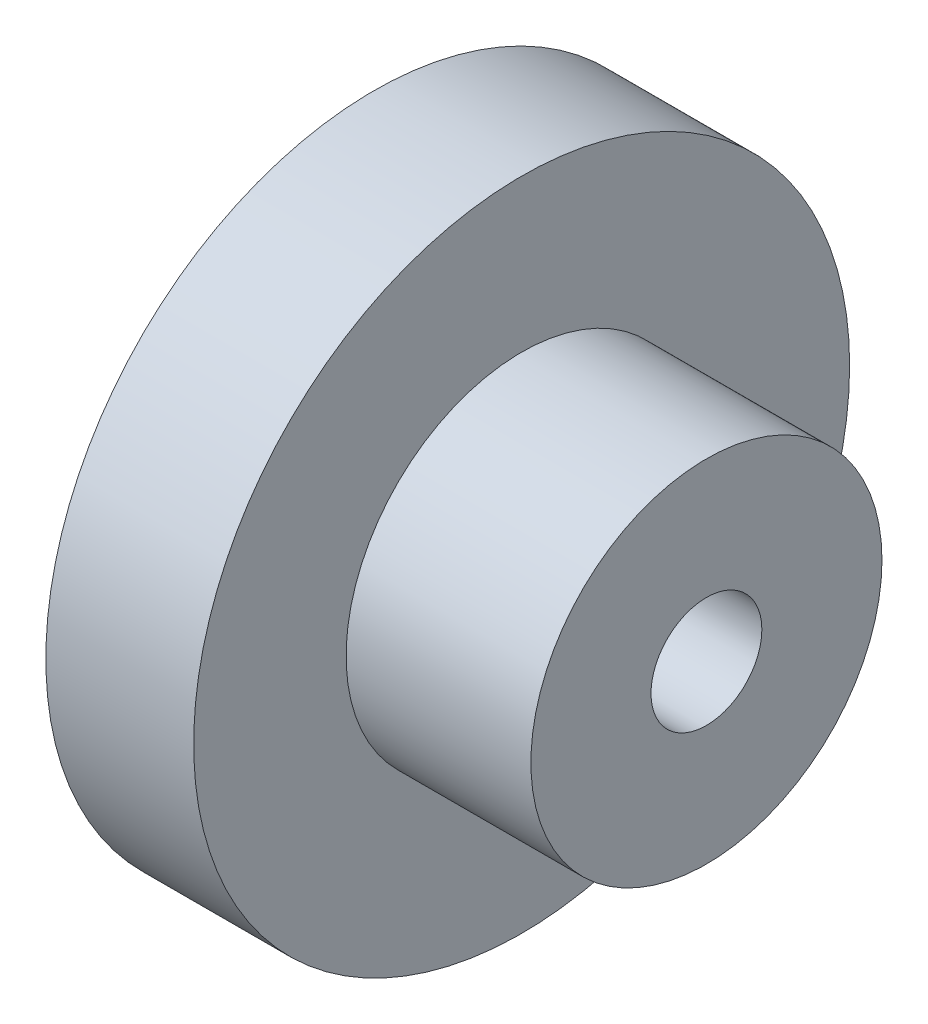
ISO-10303-21;
HEADER;
FILE_DESCRIPTION(('STEP AP214'),'2;1');
FILE_NAME('part.step','',(''),(''),'','','');
FILE_SCHEMA(('AUTOMOTIVE_DESIGN { 1 0 10303 214 1 1 1 1 }'));
ENDSEC;
DATA;
#1=APPLICATION_CONTEXT('core data for automotive mechanical design processes');
#2=APPLICATION_PROTOCOL_DEFINITION('international standard','automotive_design',2000,#1);
#3=PRODUCT_CONTEXT('',#1,'mechanical');
#4=PRODUCT('Part','Part','',(#3));
#5=PRODUCT_RELATED_PRODUCT_CATEGORY('part','',(#4));
#6=PRODUCT_DEFINITION_FORMATION('','',#4);
#7=PRODUCT_DEFINITION_CONTEXT('part definition',#1,'design');
#8=PRODUCT_DEFINITION('design','',#6,#7);
#9=PRODUCT_DEFINITION_SHAPE('','',#8);
#10=(LENGTH_UNIT() NAMED_UNIT(*) SI_UNIT(.MILLI.,.METRE.));
#11=(NAMED_UNIT(*) PLANE_ANGLE_UNIT() SI_UNIT($,.RADIAN.));
#12=(NAMED_UNIT(*) SI_UNIT($,.STERADIAN.) SOLID_ANGLE_UNIT());
#13=UNCERTAINTY_MEASURE_WITH_UNIT(LENGTH_MEASURE(1.E-05),#10,'distance_accuracy_value','');
#14=(GEOMETRIC_REPRESENTATION_CONTEXT(3) GLOBAL_UNCERTAINTY_ASSIGNED_CONTEXT((#13)) GLOBAL_UNIT_ASSIGNED_CONTEXT((#10,
#11,#12)) REPRESENTATION_CONTEXT('',''));
#15=CARTESIAN_POINT('',(0.,0.,0.));
#16=DIRECTION('',(0.,0.,1.));
#17=DIRECTION('',(1.,0.,0.));
#18=AXIS2_PLACEMENT_3D('',#15,#16,#17);
#19=CARTESIAN_POINT('',(4.,0.,0.));
#20=DIRECTION('',(1.,0.,0.));
#21=DIRECTION('',(0.,0.,-1.));
#22=AXIS2_PLACEMENT_3D('',#19,#20,#21);
#23=PLANE('',#22);
#24=CARTESIAN_POINT('',(4.,0.,0.));
#25=DIRECTION('',(1.,0.,0.));
#26=DIRECTION('',(0.,0.,-1.));
#27=AXIS2_PLACEMENT_3D('',#24,#25,#26);
#28=CIRCLE('',#27,8.875);
#29=CARTESIAN_POINT('',(4.,0.,-8.875));
#30=VERTEX_POINT('',#29);
#31=EDGE_CURVE('E10',#30,#30,#28,.T.);
#32=ORIENTED_EDGE('',*,*,#31,.T.);
#33=EDGE_LOOP('',(#32));
#34=FACE_BOUND('',#33,.T.);
#35=CARTESIAN_POINT('',(4.,0.,0.));
#36=DIRECTION('',(1.,0.,0.));
#37=DIRECTION('',(0.,0.,-1.));
#38=AXIS2_PLACEMENT_3D('',#35,#36,#37);
#39=CIRCLE('',#38,4.75);
#40=CARTESIAN_POINT('',(4.,0.,-4.75));
#41=VERTEX_POINT('',#40);
#42=EDGE_CURVE('E45',#41,#41,#39,.T.);
#43=ORIENTED_EDGE('',*,*,#42,.F.);
#44=EDGE_LOOP('',(#43));
#45=FACE_BOUND('',#44,.T.);
#46=ADVANCED_FACE('F32',(#34,#45),#23,.T.);
#47=CARTESIAN_POINT('',(4.,0.,0.));
#48=DIRECTION('',(-1.,0.,0.));
#49=DIRECTION('',(0.,0.,1.));
#50=AXIS2_PLACEMENT_3D('',#47,#48,#49);
#51=CYLINDRICAL_SURFACE('',#50,8.875);
#52=ORIENTED_EDGE('',*,*,#31,.F.);
#53=EDGE_LOOP('',(#52));
#54=FACE_BOUND('',#53,.T.);
#55=CARTESIAN_POINT('',(0.,0.,0.));
#56=DIRECTION('',(1.,0.,0.));
#57=DIRECTION('',(0.,0.,-1.));
#58=AXIS2_PLACEMENT_3D('',#55,#56,#57);
#59=CIRCLE('',#58,8.875);
#60=CARTESIAN_POINT('',(0.,0.,-8.875));
#61=VERTEX_POINT('',#60);
#62=EDGE_CURVE('E36',#61,#61,#59,.T.);
#63=ORIENTED_EDGE('',*,*,#62,.T.);
#64=EDGE_LOOP('',(#63));
#65=FACE_BOUND('',#64,.T.);
#66=ADVANCED_FACE('F34',(#54,#65),#51,.T.);
#67=CARTESIAN_POINT('',(0.,0.,0.));
#68=DIRECTION('',(1.,0.,0.));
#69=DIRECTION('',(0.,0.,-1.));
#70=AXIS2_PLACEMENT_3D('',#67,#68,#69);
#71=PLANE('',#70);
#72=CARTESIAN_POINT('',(0.,0.,0.));
#73=DIRECTION('',(1.,0.,0.));
#74=DIRECTION('',(0.,0.,-1.));
#75=AXIS2_PLACEMENT_3D('',#72,#73,#74);
#76=CIRCLE('',#75,1.5);
#77=CARTESIAN_POINT('',(0.,0.,-1.5));
#78=VERTEX_POINT('',#77);
#79=EDGE_CURVE('E48',#78,#78,#76,.T.);
#80=ORIENTED_EDGE('',*,*,#79,.T.);
#81=EDGE_LOOP('',(#80));
#82=FACE_BOUND('',#81,.T.);
#83=ORIENTED_EDGE('',*,*,#62,.F.);
#84=EDGE_LOOP('',(#83));
#85=FACE_BOUND('',#84,.T.);
#86=ADVANCED_FACE('F57',(#82,#85),#71,.F.);
#87=CARTESIAN_POINT('',(9.,0.,0.));
#88=DIRECTION('',(-1.,0.,0.));
#89=DIRECTION('',(0.,0.,1.));
#90=AXIS2_PLACEMENT_3D('',#87,#88,#89);
#91=CYLINDRICAL_SURFACE('',#90,4.75);
#92=CARTESIAN_POINT('',(9.,0.,0.));
#93=DIRECTION('',(1.,0.,0.));
#94=DIRECTION('',(0.,0.,-1.));
#95=AXIS2_PLACEMENT_3D('',#92,#93,#94);
#96=CIRCLE('',#95,4.75);
#97=CARTESIAN_POINT('',(9.,0.,-4.75));
#98=VERTEX_POINT('',#97);
#99=EDGE_CURVE('E43',#98,#98,#96,.T.);
#100=ORIENTED_EDGE('',*,*,#99,.F.);
#101=EDGE_LOOP('',(#100));
#102=FACE_BOUND('',#101,.T.);
#103=ORIENTED_EDGE('',*,*,#42,.T.);
#104=EDGE_LOOP('',(#103));
#105=FACE_BOUND('',#104,.T.);
#106=ADVANCED_FACE('F69',(#102,#105),#91,.T.);
#107=CARTESIAN_POINT('',(9.,0.,0.));
#108=DIRECTION('',(1.,0.,0.));
#109=DIRECTION('',(0.,0.,-1.));
#110=AXIS2_PLACEMENT_3D('',#107,#108,#109);
#111=PLANE('',#110);
#112=CARTESIAN_POINT('',(9.,0.,0.));
#113=DIRECTION('',(1.,0.,0.));
#114=DIRECTION('',(0.,0.,-1.));
#115=AXIS2_PLACEMENT_3D('',#112,#113,#114);
#116=CIRCLE('',#115,1.5);
#117=CARTESIAN_POINT('',(9.,0.,-1.5));
#118=VERTEX_POINT('',#117);
#119=EDGE_CURVE('E51',#118,#118,#116,.T.);
#120=ORIENTED_EDGE('',*,*,#119,.F.);
#121=EDGE_LOOP('',(#120));
#122=FACE_BOUND('',#121,.T.);
#123=ORIENTED_EDGE('',*,*,#99,.T.);
#124=EDGE_LOOP('',(#123));
#125=FACE_BOUND('',#124,.T.);
#126=ADVANCED_FACE('F63',(#122,#125),#111,.T.);
#127=CARTESIAN_POINT('',(0.,0.,0.));
#128=DIRECTION('',(1.,0.,0.));
#129=DIRECTION('',(0.,0.,-1.));
#130=AXIS2_PLACEMENT_3D('',#127,#128,#129);
#131=CYLINDRICAL_SURFACE('',#130,1.5);
#132=ORIENTED_EDGE('',*,*,#79,.F.);
#133=EDGE_LOOP('',(#132));
#134=FACE_BOUND('',#133,.T.);
#135=ORIENTED_EDGE('',*,*,#119,.T.);
#136=EDGE_LOOP('',(#135));
#137=FACE_BOUND('',#136,.T.);
#138=ADVANCED_FACE('F60',(#134,#137),#131,.F.);
#139=CLOSED_SHELL('',(#46,#66,#86,#106,#126,#138));
#140=MANIFOLD_SOLID_BREP('B2',#139);
#141=ADVANCED_BREP_SHAPE_REPRESENTATION('',(#18,#140),#14);
#142=SHAPE_DEFINITION_REPRESENTATION(#9,#141);
ENDSEC;
END-ISO-10303-21;
